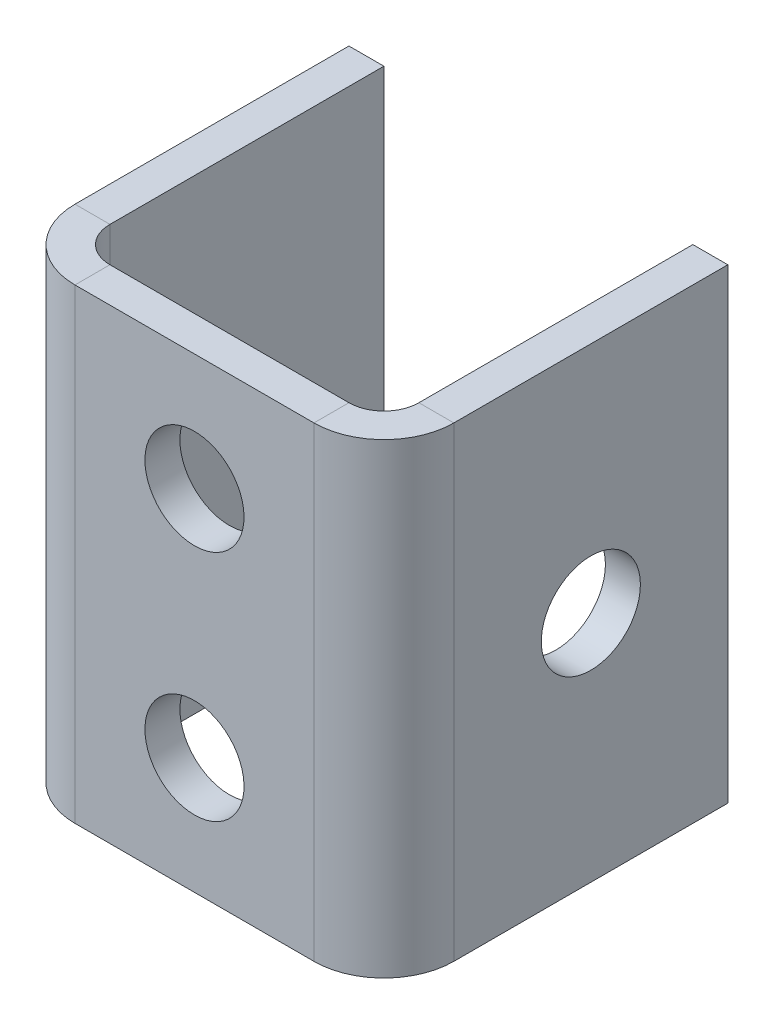
ISO-10303-21;
HEADER;
FILE_DESCRIPTION(('STEP AP214'),'2;1');
FILE_NAME('part.step','',(''),(''),'','','');
FILE_SCHEMA(('AUTOMOTIVE_DESIGN { 1 0 10303 214 1 1 1 1 }'));
ENDSEC;
DATA;
#1=APPLICATION_CONTEXT('core data for automotive mechanical design processes');
#2=APPLICATION_PROTOCOL_DEFINITION('international standard','automotive_design',2000,#1);
#3=PRODUCT_CONTEXT('',#1,'mechanical');
#4=PRODUCT('Part','Part','',(#3));
#5=PRODUCT_RELATED_PRODUCT_CATEGORY('part','',(#4));
#6=PRODUCT_DEFINITION_FORMATION('','',#4);
#7=PRODUCT_DEFINITION_CONTEXT('part definition',#1,'design');
#8=PRODUCT_DEFINITION('design','',#6,#7);
#9=PRODUCT_DEFINITION_SHAPE('','',#8);
#10=(LENGTH_UNIT() NAMED_UNIT(*) SI_UNIT(.MILLI.,.METRE.));
#11=(NAMED_UNIT(*) PLANE_ANGLE_UNIT() SI_UNIT($,.RADIAN.));
#12=(NAMED_UNIT(*) SI_UNIT($,.STERADIAN.) SOLID_ANGLE_UNIT());
#13=UNCERTAINTY_MEASURE_WITH_UNIT(LENGTH_MEASURE(1.E-05),#10,'distance_accuracy_value','');
#14=(GEOMETRIC_REPRESENTATION_CONTEXT(3) GLOBAL_UNCERTAINTY_ASSIGNED_CONTEXT((#13)) GLOBAL_UNIT_ASSIGNED_CONTEXT((#10,
#11,#12)) REPRESENTATION_CONTEXT('',''));
#15=CARTESIAN_POINT('',(0.,0.,0.));
#16=DIRECTION('',(0.,0.,1.));
#17=DIRECTION('',(1.,0.,0.));
#18=AXIS2_PLACEMENT_3D('',#15,#16,#17);
#19=CARTESIAN_POINT('',(32.5,-127.783825389419,5.00000000000056));
#20=DIRECTION('',(0.,0.,-1.));
#21=DIRECTION('',(0.,1.,0.));
#22=AXIS2_PLACEMENT_3D('',#19,#20,#21);
#23=PLANE('',#22);
#24=DIRECTION('',(1.,0.,0.));
#25=VECTOR('',#24,1.);
#26=CARTESIAN_POINT('',(32.5,-40.,5.00000000000019));
#27=LINE('',#26,#25);
#28=CARTESIAN_POINT('',(26.5,-40.,5.00000000000019));
#29=VERTEX_POINT('',#28);
#30=CARTESIAN_POINT('',(32.5,-40.,5.00000000000019));
#31=VERTEX_POINT('',#30);
#32=EDGE_CURVE('E11',#29,#31,#27,.T.);
#33=ORIENTED_EDGE('',*,*,#32,.F.);
#34=DIRECTION('',(0.,1.,0.));
#35=VECTOR('',#34,1.);
#36=CARTESIAN_POINT('',(26.5,-127.783825389419,5.00000000000019));
#37=LINE('',#36,#35);
#38=CARTESIAN_POINT('',(26.5,40.,4.99999999999986));
#39=VERTEX_POINT('',#38);
#40=EDGE_CURVE('E138',#29,#39,#37,.T.);
#41=ORIENTED_EDGE('',*,*,#40,.T.);
#42=DIRECTION('',(1.,0.,0.));
#43=VECTOR('',#42,1.);
#44=CARTESIAN_POINT('',(32.5,40.,4.99999999999986));
#45=LINE('',#44,#43);
#46=CARTESIAN_POINT('',(32.5,40.,4.99999999999986));
#47=VERTEX_POINT('',#46);
#48=EDGE_CURVE('E51',#39,#47,#45,.T.);
#49=ORIENTED_EDGE('',*,*,#48,.T.);
#50=DIRECTION('',(0.,1.,0.));
#51=VECTOR('',#50,1.);
#52=CARTESIAN_POINT('',(32.5,-127.783825389419,5.00000000000056));
#53=LINE('',#52,#51);
#54=EDGE_CURVE('E235',#31,#47,#53,.T.);
#55=ORIENTED_EDGE('',*,*,#54,.F.);
#56=EDGE_LOOP('',(#33,#41,#49,#55));
#57=FACE_BOUND('',#56,.T.);
#58=ADVANCED_FACE('F40',(#57),#23,.T.);
#59=CARTESIAN_POINT('',(32.5,40.0000000000002,57.9999999999999));
#60=DIRECTION('',(0.,-1.,0.));
#61=DIRECTION('',(0.,0.,-1.));
#62=AXIS2_PLACEMENT_3D('',#59,#60,#61);
#63=PLANE('',#62);
#64=ORIENTED_EDGE('',*,*,#48,.F.);
#65=DIRECTION('',(0.,0.,-1.));
#66=VECTOR('',#65,1.);
#67=CARTESIAN_POINT('',(26.5,40.0000000000002,58.0000000000006));
#68=LINE('',#67,#66);
#69=CARTESIAN_POINT('',(26.5,40.0000000000002,51.9999999999999));
#70=VERTEX_POINT('',#69);
#71=EDGE_CURVE('E145',#70,#39,#68,.T.);
#72=ORIENTED_EDGE('',*,*,#71,.F.);
#73=DIRECTION('',(1.,0.,0.));
#74=VECTOR('',#73,1.);
#75=CARTESIAN_POINT('',(32.5,40.0000000000002,51.9999999999999));
#76=LINE('',#75,#74);
#77=CARTESIAN_POINT('',(32.5,40.0000000000002,51.9999999999999));
#78=VERTEX_POINT('',#77);
#79=EDGE_CURVE('E59',#70,#78,#76,.T.);
#80=ORIENTED_EDGE('',*,*,#79,.T.);
#81=DIRECTION('',(0.,0.,-1.));
#82=VECTOR('',#81,1.);
#83=CARTESIAN_POINT('',(32.5,40.0000000000002,57.9999999999999));
#84=LINE('',#83,#82);
#85=EDGE_CURVE('E238',#78,#47,#84,.T.);
#86=ORIENTED_EDGE('',*,*,#85,.T.);
#87=EDGE_LOOP('',(#64,#72,#80,#86));
#88=FACE_BOUND('',#87,.T.);
#89=ADVANCED_FACE('F242',(#88),#63,.F.);
#90=CARTESIAN_POINT('',(20.5,40.0000000000002,51.9999999999999));
#91=DIRECTION('',(0.,-1.,0.));
#92=DIRECTION('',(0.,0.,-1.));
#93=AXIS2_PLACEMENT_3D('',#90,#91,#92);
#94=PLANE('',#93);
#95=ORIENTED_EDGE('',*,*,#79,.F.);
#96=CARTESIAN_POINT('',(20.5,40.0000000000002,51.9999999999999));
#97=DIRECTION('',(0.,1.,0.));
#98=DIRECTION('',(0.,0.,1.));
#99=AXIS2_PLACEMENT_3D('',#96,#97,#98);
#100=CIRCLE('',#99,6.);
#101=CARTESIAN_POINT('',(20.5,40.0000000000002,57.9999999999999));
#102=VERTEX_POINT('',#101);
#103=EDGE_CURVE('E131',#102,#70,#100,.T.);
#104=ORIENTED_EDGE('',*,*,#103,.F.);
#105=DIRECTION('',(0.,0.,1.));
#106=VECTOR('',#105,1.);
#107=CARTESIAN_POINT('',(20.5,40.0000000000003,63.9999999999999));
#108=LINE('',#107,#106);
#109=CARTESIAN_POINT('',(20.5,40.0000000000003,63.9999999999999));
#110=VERTEX_POINT('',#109);
#111=EDGE_CURVE('E226',#102,#110,#108,.T.);
#112=ORIENTED_EDGE('',*,*,#111,.T.);
#113=CARTESIAN_POINT('',(20.5,40.0000000000002,51.9999999999999));
#114=DIRECTION('',(0.,1.,0.));
#115=DIRECTION('',(1.,0.,0.));
#116=AXIS2_PLACEMENT_3D('',#113,#114,#115);
#117=CIRCLE('',#116,12.);
#118=EDGE_CURVE('E120',#110,#78,#117,.T.);
#119=ORIENTED_EDGE('',*,*,#118,.T.);
#120=EDGE_LOOP('',(#95,#104,#112,#119));
#121=FACE_BOUND('',#120,.T.);
#122=ADVANCED_FACE('F277',(#121),#94,.F.);
#123=CARTESIAN_POINT('',(-26.5,40.0000000000003,63.9999999999999));
#124=DIRECTION('',(0.,-1.,0.));
#125=DIRECTION('',(1.,0.,0.));
#126=AXIS2_PLACEMENT_3D('',#123,#124,#125);
#127=PLANE('',#126);
#128=ORIENTED_EDGE('',*,*,#111,.F.);
#129=DIRECTION('',(1.,0.,0.));
#130=VECTOR('',#129,1.);
#131=CARTESIAN_POINT('',(-26.5,40.0000000000002,57.9999999999999));
#132=LINE('',#131,#130);
#133=CARTESIAN_POINT('',(-20.5,40.0000000000002,57.9999999999999));
#134=VERTEX_POINT('',#133);
#135=EDGE_CURVE('E168',#134,#102,#132,.T.);
#136=ORIENTED_EDGE('',*,*,#135,.F.);
#137=DIRECTION('',(0.,0.,1.));
#138=VECTOR('',#137,1.);
#139=CARTESIAN_POINT('',(-20.5,40.0000000000003,63.9999999999999));
#140=LINE('',#139,#138);
#141=CARTESIAN_POINT('',(-20.5,40.0000000000003,63.9999999999999));
#142=VERTEX_POINT('',#141);
#143=EDGE_CURVE('E222',#134,#142,#140,.T.);
#144=ORIENTED_EDGE('',*,*,#143,.T.);
#145=DIRECTION('',(1.,0.,0.));
#146=VECTOR('',#145,1.);
#147=CARTESIAN_POINT('',(-26.5,40.0000000000003,63.9999999999999));
#148=LINE('',#147,#146);
#149=EDGE_CURVE('E274',#142,#110,#148,.T.);
#150=ORIENTED_EDGE('',*,*,#149,.T.);
#151=EDGE_LOOP('',(#128,#136,#144,#150));
#152=FACE_BOUND('',#151,.T.);
#153=ADVANCED_FACE('F269',(#152),#127,.F.);
#154=CARTESIAN_POINT('',(-20.5,40.0000000000002,51.9999999999999));
#155=DIRECTION('',(0.,-1.,0.));
#156=DIRECTION('',(0.,0.,-1.));
#157=AXIS2_PLACEMENT_3D('',#154,#155,#156);
#158=PLANE('',#157);
#159=ORIENTED_EDGE('',*,*,#143,.F.);
#160=CARTESIAN_POINT('',(-20.5,40.0000000000002,51.9999999999999));
#161=DIRECTION('',(0.,1.,0.));
#162=DIRECTION('',(0.,0.,1.));
#163=AXIS2_PLACEMENT_3D('',#160,#161,#162);
#164=CIRCLE('',#163,6.);
#165=CARTESIAN_POINT('',(-26.5,40.0000000000002,51.9999999999999));
#166=VERTEX_POINT('',#165);
#167=EDGE_CURVE('E167',#166,#134,#164,.T.);
#168=ORIENTED_EDGE('',*,*,#167,.F.);
#169=DIRECTION('',(-1.,0.,0.));
#170=VECTOR('',#169,1.);
#171=CARTESIAN_POINT('',(-32.5,40.0000000000002,51.9999999999999));
#172=LINE('',#171,#170);
#173=CARTESIAN_POINT('',(-32.5,40.0000000000002,51.9999999999999));
#174=VERTEX_POINT('',#173);
#175=EDGE_CURVE('E218',#166,#174,#172,.T.);
#176=ORIENTED_EDGE('',*,*,#175,.T.);
#177=CARTESIAN_POINT('',(-20.5,40.0000000000002,51.9999999999999));
#178=DIRECTION('',(0.,1.,0.));
#179=DIRECTION('',(1.,0.,0.));
#180=AXIS2_PLACEMENT_3D('',#177,#178,#179);
#181=CIRCLE('',#180,12.);
#182=EDGE_CURVE('E347',#174,#142,#181,.T.);
#183=ORIENTED_EDGE('',*,*,#182,.T.);
#184=EDGE_LOOP('',(#159,#168,#176,#183));
#185=FACE_BOUND('',#184,.T.);
#186=ADVANCED_FACE('F527',(#185),#158,.F.);
#187=CARTESIAN_POINT('',(-32.5,40.,4.99999999999986));
#188=DIRECTION('',(0.,-1.,0.));
#189=DIRECTION('',(0.,0.,1.));
#190=AXIS2_PLACEMENT_3D('',#187,#188,#189);
#191=PLANE('',#190);
#192=ORIENTED_EDGE('',*,*,#175,.F.);
#193=DIRECTION('',(0.,0.,1.));
#194=VECTOR('',#193,1.);
#195=CARTESIAN_POINT('',(-26.5,40.,5.00000000000056));
#196=LINE('',#195,#194);
#197=CARTESIAN_POINT('',(-26.5,40.,4.99999999999986));
#198=VERTEX_POINT('',#197);
#199=EDGE_CURVE('E177',#198,#166,#196,.T.);
#200=ORIENTED_EDGE('',*,*,#199,.F.);
#201=DIRECTION('',(-1.,0.,0.));
#202=VECTOR('',#201,1.);
#203=CARTESIAN_POINT('',(-32.5,40.,4.99999999999986));
#204=LINE('',#203,#202);
#205=CARTESIAN_POINT('',(-32.5,40.,4.99999999999986));
#206=VERTEX_POINT('',#205);
#207=EDGE_CURVE('E214',#198,#206,#204,.T.);
#208=ORIENTED_EDGE('',*,*,#207,.T.);
#209=DIRECTION('',(0.,0.,1.));
#210=VECTOR('',#209,1.);
#211=CARTESIAN_POINT('',(-32.5,40.,4.99999999999986));
#212=LINE('',#211,#210);
#213=EDGE_CURVE('E309',#206,#174,#212,.T.);
#214=ORIENTED_EDGE('',*,*,#213,.T.);
#215=EDGE_LOOP('',(#192,#200,#208,#214));
#216=FACE_BOUND('',#215,.T.);
#217=ADVANCED_FACE('F389',(#216),#191,.F.);
#218=CARTESIAN_POINT('',(-32.5,-127.783825389419,5.00000000000056));
#219=DIRECTION('',(0.,0.,1.));
#220=DIRECTION('',(0.,1.,0.));
#221=AXIS2_PLACEMENT_3D('',#218,#219,#220);
#222=PLANE('',#221);
#223=ORIENTED_EDGE('',*,*,#207,.F.);
#224=DIRECTION('',(0.,1.,0.));
#225=VECTOR('',#224,1.);
#226=CARTESIAN_POINT('',(-26.5,-127.783825389419,4.99999999999986));
#227=LINE('',#226,#225);
#228=CARTESIAN_POINT('',(-26.5,-40.,4.99999999999986));
#229=VERTEX_POINT('',#228);
#230=EDGE_CURVE('E173',#229,#198,#227,.T.);
#231=ORIENTED_EDGE('',*,*,#230,.F.);
#232=DIRECTION('',(-1.,0.,0.));
#233=VECTOR('',#232,1.);
#234=CARTESIAN_POINT('',(-32.5,-40.,4.99999999999986));
#235=LINE('',#234,#233);
#236=CARTESIAN_POINT('',(-32.5,-40.,4.99999999999986));
#237=VERTEX_POINT('',#236);
#238=EDGE_CURVE('E210',#229,#237,#235,.T.);
#239=ORIENTED_EDGE('',*,*,#238,.T.);
#240=DIRECTION('',(0.,1.,0.));
#241=VECTOR('',#240,1.);
#242=CARTESIAN_POINT('',(-32.5,-127.783825389419,5.00000000000056));
#243=LINE('',#242,#241);
#244=EDGE_CURVE('E150',#237,#206,#243,.T.);
#245=ORIENTED_EDGE('',*,*,#244,.T.);
#246=EDGE_LOOP('',(#223,#231,#239,#245));
#247=FACE_BOUND('',#246,.T.);
#248=ADVANCED_FACE('F297',(#247),#222,.F.);
#249=CARTESIAN_POINT('',(-32.5,-39.9999999999998,5.00000000000056));
#250=DIRECTION('',(0.,-1.,0.));
#251=DIRECTION('',(0.,0.,1.));
#252=AXIS2_PLACEMENT_3D('',#249,#250,#251);
#253=PLANE('',#252);
#254=ORIENTED_EDGE('',*,*,#238,.F.);
#255=DIRECTION('',(0.,0.,1.));
#256=VECTOR('',#255,1.);
#257=CARTESIAN_POINT('',(-26.5,-39.9999999999998,5.00000000000056));
#258=LINE('',#257,#256);
#259=CARTESIAN_POINT('',(-26.5,-39.9999999999998,52.0000000000002));
#260=VERTEX_POINT('',#259);
#261=EDGE_CURVE('E169',#260,#229,#258,.F.);
#262=ORIENTED_EDGE('',*,*,#261,.F.);
#263=DIRECTION('',(-1.,0.,0.));
#264=VECTOR('',#263,1.);
#265=CARTESIAN_POINT('',(-32.5,-39.9999999999998,52.0000000000002));
#266=LINE('',#265,#264);
#267=CARTESIAN_POINT('',(-32.5,-39.9999999999998,52.0000000000002));
#268=VERTEX_POINT('',#267);
#269=EDGE_CURVE('E206',#260,#268,#266,.T.);
#270=ORIENTED_EDGE('',*,*,#269,.T.);
#271=DIRECTION('',(0.,0.,1.));
#272=VECTOR('',#271,1.);
#273=CARTESIAN_POINT('',(-32.5,-39.9999999999998,5.00000000000056));
#274=LINE('',#273,#272);
#275=EDGE_CURVE('E306',#268,#237,#274,.F.);
#276=ORIENTED_EDGE('',*,*,#275,.T.);
#277=EDGE_LOOP('',(#254,#262,#270,#276));
#278=FACE_BOUND('',#277,.T.);
#279=ADVANCED_FACE('F312',(#278),#253,.T.);
#280=CARTESIAN_POINT('',(-20.5,-39.9999999999998,52.0000000000002));
#281=DIRECTION('',(0.,1.,0.));
#282=DIRECTION('',(0.,0.,1.));
#283=AXIS2_PLACEMENT_3D('',#280,#281,#282);
#284=PLANE('',#283);
#285=ORIENTED_EDGE('',*,*,#269,.F.);
#286=CARTESIAN_POINT('',(-20.5,-39.9999999999998,52.0000000000002));
#287=DIRECTION('',(0.,1.,0.));
#288=DIRECTION('',(0.,0.,1.));
#289=AXIS2_PLACEMENT_3D('',#286,#287,#288);
#290=CIRCLE('',#289,6.);
#291=CARTESIAN_POINT('',(-20.5,-39.9999999999998,58.0000000000002));
#292=VERTEX_POINT('',#291);
#293=EDGE_CURVE('E163',#292,#260,#290,.F.);
#294=ORIENTED_EDGE('',*,*,#293,.F.);
#295=DIRECTION('',(0.,0.,1.));
#296=VECTOR('',#295,1.);
#297=CARTESIAN_POINT('',(-20.5,-39.9999999999997,64.0000000000004));
#298=LINE('',#297,#296);
#299=CARTESIAN_POINT('',(-20.5,-39.9999999999997,64.0000000000004));
#300=VERTEX_POINT('',#299);
#301=EDGE_CURVE('E202',#292,#300,#298,.T.);
#302=ORIENTED_EDGE('',*,*,#301,.T.);
#303=CARTESIAN_POINT('',(-20.5,-39.9999999999998,52.0000000000002));
#304=DIRECTION('',(0.,-1.,0.));
#305=DIRECTION('',(0.,0.,-1.));
#306=AXIS2_PLACEMENT_3D('',#303,#304,#305);
#307=CIRCLE('',#306,12.);
#308=EDGE_CURVE('E344',#300,#268,#307,.T.);
#309=ORIENTED_EDGE('',*,*,#308,.T.);
#310=EDGE_LOOP('',(#285,#294,#302,#309));
#311=FACE_BOUND('',#310,.T.);
#312=ADVANCED_FACE('F383',(#311),#284,.F.);
#313=CARTESIAN_POINT('',(-26.5,-39.9999999999997,64.0000000000002));
#314=DIRECTION('',(0.,-1.,0.));
#315=DIRECTION('',(1.,0.,0.));
#316=AXIS2_PLACEMENT_3D('',#313,#314,#315);
#317=PLANE('',#316);
#318=ORIENTED_EDGE('',*,*,#301,.F.);
#319=DIRECTION('',(1.,0.,0.));
#320=VECTOR('',#319,1.);
#321=CARTESIAN_POINT('',(-26.5,-39.9999999999998,58.0000000000002));
#322=LINE('',#321,#320);
#323=CARTESIAN_POINT('',(20.5,-39.9999999999998,58.0000000000002));
#324=VERTEX_POINT('',#323);
#325=EDGE_CURVE('E157',#324,#292,#322,.F.);
#326=ORIENTED_EDGE('',*,*,#325,.F.);
#327=DIRECTION('',(0.,0.,1.));
#328=VECTOR('',#327,1.);
#329=CARTESIAN_POINT('',(20.5,-39.9999999999997,64.0000000000002));
#330=LINE('',#329,#328);
#331=CARTESIAN_POINT('',(20.5,-39.9999999999997,64.0000000000002));
#332=VERTEX_POINT('',#331);
#333=EDGE_CURVE('E119',#324,#332,#330,.T.);
#334=ORIENTED_EDGE('',*,*,#333,.T.);
#335=DIRECTION('',(1.,0.,0.));
#336=VECTOR('',#335,1.);
#337=CARTESIAN_POINT('',(-26.5,-39.9999999999997,64.0000000000002));
#338=LINE('',#337,#336);
#339=EDGE_CURVE('E334',#332,#300,#338,.F.);
#340=ORIENTED_EDGE('',*,*,#339,.T.);
#341=EDGE_LOOP('',(#318,#326,#334,#340));
#342=FACE_BOUND('',#341,.T.);
#343=ADVANCED_FACE('F380',(#342),#317,.T.);
#344=CARTESIAN_POINT('',(20.5,-39.9999999999998,52.0000000000002));
#345=DIRECTION('',(0.,1.,0.));
#346=DIRECTION('',(0.,0.,1.));
#347=AXIS2_PLACEMENT_3D('',#344,#345,#346);
#348=PLANE('',#347);
#349=ORIENTED_EDGE('',*,*,#333,.F.);
#350=CARTESIAN_POINT('',(20.5,-39.9999999999998,52.0000000000002));
#351=DIRECTION('',(0.,1.,0.));
#352=DIRECTION('',(0.,0.,1.));
#353=AXIS2_PLACEMENT_3D('',#350,#351,#352);
#354=CIRCLE('',#353,6.);
#355=CARTESIAN_POINT('',(26.5,-39.9999999999998,52.0000000000009));
#356=VERTEX_POINT('',#355);
#357=EDGE_CURVE('E128',#356,#324,#354,.F.);
#358=ORIENTED_EDGE('',*,*,#357,.F.);
#359=DIRECTION('',(1.,0.,0.));
#360=VECTOR('',#359,1.);
#361=CARTESIAN_POINT('',(32.5,-39.9999999999998,52.0000000000009));
#362=LINE('',#361,#360);
#363=CARTESIAN_POINT('',(32.5,-39.9999999999998,52.0000000000009));
#364=VERTEX_POINT('',#363);
#365=EDGE_CURVE('E44',#356,#364,#362,.T.);
#366=ORIENTED_EDGE('',*,*,#365,.T.);
#367=CARTESIAN_POINT('',(20.5,-39.9999999999998,52.0000000000002));
#368=DIRECTION('',(0.,-1.,0.));
#369=DIRECTION('',(0.,0.,-1.));
#370=AXIS2_PLACEMENT_3D('',#367,#368,#369);
#371=CIRCLE('',#370,12.);
#372=EDGE_CURVE('E244',#364,#332,#371,.T.);
#373=ORIENTED_EDGE('',*,*,#372,.T.);
#374=EDGE_LOOP('',(#349,#358,#366,#373));
#375=FACE_BOUND('',#374,.T.);
#376=ADVANCED_FACE('F141',(#375),#348,.F.);
#377=CARTESIAN_POINT('',(0.,20.0000000000003,64.));
#378=DIRECTION('',(0.,0.,1.));
#379=DIRECTION('',(0.,-1.,0.));
#380=AXIS2_PLACEMENT_3D('',#377,#378,#379);
#381=CYLINDRICAL_SURFACE('',#380,8.49999999999999);
#382=CARTESIAN_POINT('',(0.,20.0000000000003,64.));
#383=DIRECTION('',(0.,0.,1.));
#384=DIRECTION('',(0.,-1.,0.));
#385=AXIS2_PLACEMENT_3D('',#382,#383,#384);
#386=CIRCLE('',#385,8.49999999999999);
#387=CARTESIAN_POINT('',(0.,11.5000000000003,64.0000000000001));
#388=VERTEX_POINT('',#387);
#389=EDGE_CURVE('E322',#388,#388,#386,.T.);
#390=ORIENTED_EDGE('',*,*,#389,.T.);
#391=EDGE_LOOP('',(#390));
#392=FACE_BOUND('',#391,.T.);
#393=CARTESIAN_POINT('',(0.,20.0000000000002,58.));
#394=DIRECTION('',(0.,0.,1.));
#395=DIRECTION('',(0.,-1.,0.));
#396=AXIS2_PLACEMENT_3D('',#393,#394,#395);
#397=CIRCLE('',#396,8.49999999999999);
#398=CARTESIAN_POINT('',(0.,11.5000000000002,58.));
#399=VERTEX_POINT('',#398);
#400=EDGE_CURVE('E181',#399,#399,#397,.T.);
#401=ORIENTED_EDGE('',*,*,#400,.F.);
#402=EDGE_LOOP('',(#401));
#403=FACE_BOUND('',#402,.T.);
#404=ADVANCED_FACE('F422',(#392,#403),#381,.F.);
#405=CARTESIAN_POINT('',(0.,-19.9999999999997,64.));
#406=DIRECTION('',(0.,0.,1.));
#407=DIRECTION('',(0.,-1.,0.));
#408=AXIS2_PLACEMENT_3D('',#405,#406,#407);
#409=CYLINDRICAL_SURFACE('',#408,8.49999999999999);
#410=CARTESIAN_POINT('',(0.,-19.9999999999997,64.));
#411=DIRECTION('',(0.,0.,1.));
#412=DIRECTION('',(0.,-1.,0.));
#413=AXIS2_PLACEMENT_3D('',#410,#411,#412);
#414=CIRCLE('',#413,8.49999999999999);
#415=CARTESIAN_POINT('',(0.,-28.4999999999997,64.0000000000001));
#416=VERTEX_POINT('',#415);
#417=EDGE_CURVE('E326',#416,#416,#414,.T.);
#418=ORIENTED_EDGE('',*,*,#417,.T.);
#419=EDGE_LOOP('',(#418));
#420=FACE_BOUND('',#419,.T.);
#421=CARTESIAN_POINT('',(0.,-19.9999999999998,58.));
#422=DIRECTION('',(0.,0.,1.));
#423=DIRECTION('',(0.,-1.,0.));
#424=AXIS2_PLACEMENT_3D('',#421,#422,#423);
#425=CIRCLE('',#424,8.49999999999999);
#426=CARTESIAN_POINT('',(0.,-28.4999999999998,58.));
#427=VERTEX_POINT('',#426);
#428=EDGE_CURVE('E196',#427,#427,#425,.T.);
#429=ORIENTED_EDGE('',*,*,#428,.F.);
#430=EDGE_LOOP('',(#429));
#431=FACE_BOUND('',#430,.T.);
#432=ADVANCED_FACE('F42',(#420,#431),#409,.F.);
#433=CARTESIAN_POINT('',(32.5,2.13262567327899E-13,28.4999999999999));
#434=DIRECTION('',(1.,0.,0.));
#435=DIRECTION('',(0.,0.,-1.));
#436=AXIS2_PLACEMENT_3D('',#433,#434,#435);
#437=CYLINDRICAL_SURFACE('',#436,8.49999999999999);
#438=CARTESIAN_POINT('',(32.5,2.13262567327899E-13,28.4999999999999));
#439=DIRECTION('',(1.,0.,0.));
#440=DIRECTION('',(0.,0.,-1.));
#441=AXIS2_PLACEMENT_3D('',#438,#439,#440);
#442=CIRCLE('',#441,8.49999999999999);
#443=CARTESIAN_POINT('',(32.5,2.13262567327899E-13,19.9999999999999));
#444=VERTEX_POINT('',#443);
#445=EDGE_CURVE('E351',#444,#444,#442,.T.);
#446=ORIENTED_EDGE('',*,*,#445,.T.);
#447=EDGE_LOOP('',(#446));
#448=FACE_BOUND('',#447,.T.);
#449=CARTESIAN_POINT('',(26.5,2.13262567327899E-13,28.4999999999999));
#450=DIRECTION('',(1.,0.,0.));
#451=DIRECTION('',(0.,0.,-1.));
#452=AXIS2_PLACEMENT_3D('',#449,#450,#451);
#453=CIRCLE('',#452,8.49999999999999);
#454=CARTESIAN_POINT('',(26.5,2.13262567327899E-13,19.9999999999999));
#455=VERTEX_POINT('',#454);
#456=EDGE_CURVE('E135',#455,#455,#453,.T.);
#457=ORIENTED_EDGE('',*,*,#456,.F.);
#458=EDGE_LOOP('',(#457));
#459=FACE_BOUND('',#458,.T.);
#460=ADVANCED_FACE('F419',(#448,#459),#437,.F.);
#461=CARTESIAN_POINT('',(32.5,-39.9999999999998,58.0000000000002));
#462=DIRECTION('',(0.,1.,0.));
#463=DIRECTION('',(0.,0.,1.));
#464=AXIS2_PLACEMENT_3D('',#461,#462,#463);
#465=PLANE('',#464);
#466=DIRECTION('',(0.,0.,-1.));
#467=VECTOR('',#466,1.);
#468=CARTESIAN_POINT('',(26.5,-40.,58.0000000000006));
#469=LINE('',#468,#467);
#470=EDGE_CURVE('E109',#29,#356,#469,.F.);
#471=ORIENTED_EDGE('',*,*,#470,.F.);
#472=ORIENTED_EDGE('',*,*,#32,.T.);
#473=DIRECTION('',(0.,0.,1.));
#474=VECTOR('',#473,1.);
#475=CARTESIAN_POINT('',(32.5,-39.9999999999998,58.0000000000002));
#476=LINE('',#475,#474);
#477=EDGE_CURVE('E112',#31,#364,#476,.T.);
#478=ORIENTED_EDGE('',*,*,#477,.T.);
#479=ORIENTED_EDGE('',*,*,#365,.F.);
#480=EDGE_LOOP('',(#471,#472,#478,#479));
#481=FACE_BOUND('',#480,.T.);
#482=ADVANCED_FACE('F107',(#481),#465,.F.);
#483=CARTESIAN_POINT('',(20.5,-127.783825389419,52.0000000000006));
#484=DIRECTION('',(0.,1.,0.));
#485=DIRECTION('',(0.,0.,1.));
#486=AXIS2_PLACEMENT_3D('',#483,#484,#485);
#487=CYLINDRICAL_SURFACE('',#486,12.);
#488=DIRECTION('',(0.,1.,0.));
#489=VECTOR('',#488,1.);
#490=CARTESIAN_POINT('',(20.5,-127.783825389419,64.0000000000006));
#491=LINE('',#490,#489);
#492=EDGE_CURVE('E338',#332,#110,#491,.T.);
#493=ORIENTED_EDGE('',*,*,#492,.F.);
#494=ORIENTED_EDGE('',*,*,#372,.F.);
#495=DIRECTION('',(0.,1.,0.));
#496=VECTOR('',#495,1.);
#497=CARTESIAN_POINT('',(32.5,-127.783825389419,52.0000000000006));
#498=LINE('',#497,#496);
#499=EDGE_CURVE('E355',#364,#78,#498,.T.);
#500=ORIENTED_EDGE('',*,*,#499,.T.);
#501=ORIENTED_EDGE('',*,*,#118,.F.);
#502=EDGE_LOOP('',(#493,#494,#500,#501));
#503=FACE_BOUND('',#502,.T.);
#504=ADVANCED_FACE('F374',(#503),#487,.T.);
#505=CARTESIAN_POINT('',(32.5,-127.783825389419,58.0000000000006));
#506=DIRECTION('',(1.,0.,0.));
#507=DIRECTION('',(0.,0.,-1.));
#508=AXIS2_PLACEMENT_3D('',#505,#506,#507);
#509=PLANE('',#508);
#510=ORIENTED_EDGE('',*,*,#445,.F.);
#511=EDGE_LOOP('',(#510));
#512=FACE_BOUND('',#511,.T.);
#513=ORIENTED_EDGE('',*,*,#499,.F.);
#514=ORIENTED_EDGE('',*,*,#477,.F.);
#515=ORIENTED_EDGE('',*,*,#54,.T.);
#516=ORIENTED_EDGE('',*,*,#85,.F.);
#517=EDGE_LOOP('',(#513,#514,#515,#516));
#518=FACE_BOUND('',#517,.T.);
#519=ADVANCED_FACE('F237',(#512,#518),#509,.T.);
#520=CARTESIAN_POINT('',(-20.5,-127.783825389419,52.0000000000006));
#521=DIRECTION('',(0.,1.,0.));
#522=DIRECTION('',(0.,0.,1.));
#523=AXIS2_PLACEMENT_3D('',#520,#521,#522);
#524=CYLINDRICAL_SURFACE('',#523,12.);
#525=DIRECTION('',(0.,1.,0.));
#526=VECTOR('',#525,1.);
#527=CARTESIAN_POINT('',(-32.5,-127.783825389419,52.0000000000006));
#528=LINE('',#527,#526);
#529=EDGE_CURVE('E314',#268,#174,#528,.T.);
#530=ORIENTED_EDGE('',*,*,#529,.F.);
#531=ORIENTED_EDGE('',*,*,#308,.F.);
#532=DIRECTION('',(0.,1.,0.));
#533=VECTOR('',#532,1.);
#534=CARTESIAN_POINT('',(-20.5,-127.783825389419,64.0000000000006));
#535=LINE('',#534,#533);
#536=EDGE_CURVE('E330',#300,#142,#535,.T.);
#537=ORIENTED_EDGE('',*,*,#536,.T.);
#538=ORIENTED_EDGE('',*,*,#182,.F.);
#539=EDGE_LOOP('',(#530,#531,#537,#538));
#540=FACE_BOUND('',#539,.T.);
#541=ADVANCED_FACE('F386',(#540),#524,.T.);
#542=CARTESIAN_POINT('',(-26.5,-127.783825389419,64.0000000000006));
#543=DIRECTION('',(0.,0.,1.));
#544=DIRECTION('',(0.,-1.,0.));
#545=AXIS2_PLACEMENT_3D('',#542,#543,#544);
#546=PLANE('',#545);
#547=ORIENTED_EDGE('',*,*,#389,.F.);
#548=EDGE_LOOP('',(#547));
#549=FACE_BOUND('',#548,.T.);
#550=ORIENTED_EDGE('',*,*,#417,.F.);
#551=EDGE_LOOP('',(#550));
#552=FACE_BOUND('',#551,.T.);
#553=ORIENTED_EDGE('',*,*,#536,.F.);
#554=ORIENTED_EDGE('',*,*,#339,.F.);
#555=ORIENTED_EDGE('',*,*,#492,.T.);
#556=ORIENTED_EDGE('',*,*,#149,.F.);
#557=EDGE_LOOP('',(#553,#554,#555,#556));
#558=FACE_BOUND('',#557,.T.);
#559=ADVANCED_FACE('F378',(#549,#552,#558),#546,.T.);
#560=CARTESIAN_POINT('',(-32.5,-127.783825389419,5.00000000000056));
#561=DIRECTION('',(-1.,0.,0.));
#562=DIRECTION('',(0.,0.,1.));
#563=AXIS2_PLACEMENT_3D('',#560,#561,#562);
#564=PLANE('',#563);
#565=ORIENTED_EDGE('',*,*,#244,.F.);
#566=ORIENTED_EDGE('',*,*,#275,.F.);
#567=ORIENTED_EDGE('',*,*,#529,.T.);
#568=ORIENTED_EDGE('',*,*,#213,.F.);
#569=EDGE_LOOP('',(#565,#566,#567,#568));
#570=FACE_BOUND('',#569,.T.);
#571=ADVANCED_FACE('F304',(#570),#564,.T.);
#572=CARTESIAN_POINT('',(20.5,-127.783825389419,52.0000000000006));
#573=DIRECTION('',(0.,1.,0.));
#574=DIRECTION('',(0.,0.,1.));
#575=AXIS2_PLACEMENT_3D('',#572,#573,#574);
#576=CYLINDRICAL_SURFACE('',#575,6.);
#577=DIRECTION('',(0.,-1.,0.));
#578=VECTOR('',#577,1.);
#579=CARTESIAN_POINT('',(20.5,-127.783825389419,58.0000000000006));
#580=LINE('',#579,#578);
#581=EDGE_CURVE('E161',#324,#102,#580,.F.);
#582=ORIENTED_EDGE('',*,*,#581,.T.);
#583=ORIENTED_EDGE('',*,*,#103,.T.);
#584=DIRECTION('',(0.,1.,0.));
#585=VECTOR('',#584,1.);
#586=CARTESIAN_POINT('',(26.5,-127.783825389419,52.0000000000006));
#587=LINE('',#586,#585);
#588=EDGE_CURVE('E125',#356,#70,#587,.T.);
#589=ORIENTED_EDGE('',*,*,#588,.F.);
#590=ORIENTED_EDGE('',*,*,#357,.T.);
#591=EDGE_LOOP('',(#582,#583,#589,#590));
#592=FACE_BOUND('',#591,.T.);
#593=ADVANCED_FACE('F127',(#592),#576,.F.);
#594=CARTESIAN_POINT('',(26.5,-127.783825389419,58.0000000000006));
#595=DIRECTION('',(1.,0.,0.));
#596=DIRECTION('',(0.,0.,-1.));
#597=AXIS2_PLACEMENT_3D('',#594,#595,#596);
#598=PLANE('',#597);
#599=ORIENTED_EDGE('',*,*,#456,.T.);
#600=EDGE_LOOP('',(#599));
#601=FACE_BOUND('',#600,.T.);
#602=ORIENTED_EDGE('',*,*,#588,.T.);
#603=ORIENTED_EDGE('',*,*,#71,.T.);
#604=ORIENTED_EDGE('',*,*,#40,.F.);
#605=ORIENTED_EDGE('',*,*,#470,.T.);
#606=EDGE_LOOP('',(#602,#603,#604,#605));
#607=FACE_BOUND('',#606,.T.);
#608=ADVANCED_FACE('F137',(#601,#607),#598,.F.);
#609=CARTESIAN_POINT('',(-20.5,-127.783825389419,52.0000000000006));
#610=DIRECTION('',(0.,1.,0.));
#611=DIRECTION('',(0.,0.,1.));
#612=AXIS2_PLACEMENT_3D('',#609,#610,#611);
#613=CYLINDRICAL_SURFACE('',#612,6.);
#614=DIRECTION('',(0.,1.,0.));
#615=VECTOR('',#614,1.);
#616=CARTESIAN_POINT('',(-26.5,-127.783825389419,52.0000000000002));
#617=LINE('',#616,#615);
#618=EDGE_CURVE('E155',#260,#166,#617,.T.);
#619=ORIENTED_EDGE('',*,*,#618,.T.);
#620=ORIENTED_EDGE('',*,*,#167,.T.);
#621=DIRECTION('',(0.,1.,0.));
#622=VECTOR('',#621,1.);
#623=CARTESIAN_POINT('',(-20.5,-127.783825389419,58.0000000000006));
#624=LINE('',#623,#622);
#625=EDGE_CURVE('E162',#292,#134,#624,.T.);
#626=ORIENTED_EDGE('',*,*,#625,.F.);
#627=ORIENTED_EDGE('',*,*,#293,.T.);
#628=EDGE_LOOP('',(#619,#620,#626,#627));
#629=FACE_BOUND('',#628,.T.);
#630=ADVANCED_FACE('F265',(#629),#613,.F.);
#631=CARTESIAN_POINT('',(-26.5,-127.783825389419,58.0000000000006));
#632=DIRECTION('',(0.,0.,1.));
#633=DIRECTION('',(0.,-1.,0.));
#634=AXIS2_PLACEMENT_3D('',#631,#632,#633);
#635=PLANE('',#634);
#636=ORIENTED_EDGE('',*,*,#400,.T.);
#637=EDGE_LOOP('',(#636));
#638=FACE_BOUND('',#637,.T.);
#639=ORIENTED_EDGE('',*,*,#428,.T.);
#640=EDGE_LOOP('',(#639));
#641=FACE_BOUND('',#640,.T.);
#642=ORIENTED_EDGE('',*,*,#625,.T.);
#643=ORIENTED_EDGE('',*,*,#135,.T.);
#644=ORIENTED_EDGE('',*,*,#581,.F.);
#645=ORIENTED_EDGE('',*,*,#325,.T.);
#646=EDGE_LOOP('',(#642,#643,#644,#645));
#647=FACE_BOUND('',#646,.T.);
#648=ADVANCED_FACE('F259',(#638,#641,#647),#635,.F.);
#649=CARTESIAN_POINT('',(-26.5,-127.783825389419,5.00000000000056));
#650=DIRECTION('',(-1.,0.,0.));
#651=DIRECTION('',(0.,0.,1.));
#652=AXIS2_PLACEMENT_3D('',#649,#650,#651);
#653=PLANE('',#652);
#654=ORIENTED_EDGE('',*,*,#230,.T.);
#655=ORIENTED_EDGE('',*,*,#199,.T.);
#656=ORIENTED_EDGE('',*,*,#618,.F.);
#657=ORIENTED_EDGE('',*,*,#261,.T.);
#658=EDGE_LOOP('',(#654,#655,#656,#657));
#659=FACE_BOUND('',#658,.T.);
#660=ADVANCED_FACE('F392',(#659),#653,.F.);
#661=CLOSED_SHELL('',(#58,#89,#122,#153,#186,#217,#248,#279,#312,#343,#376,#404,#432,#460,#482,
#504,#519,#541,#559,#571,#593,#608,#630,#648,#660));
#662=MANIFOLD_SOLID_BREP('B2',#661);
#663=ADVANCED_BREP_SHAPE_REPRESENTATION('',(#18,#662),#14);
#664=SHAPE_DEFINITION_REPRESENTATION(#9,#663);
ENDSEC;
END-ISO-10303-21;
